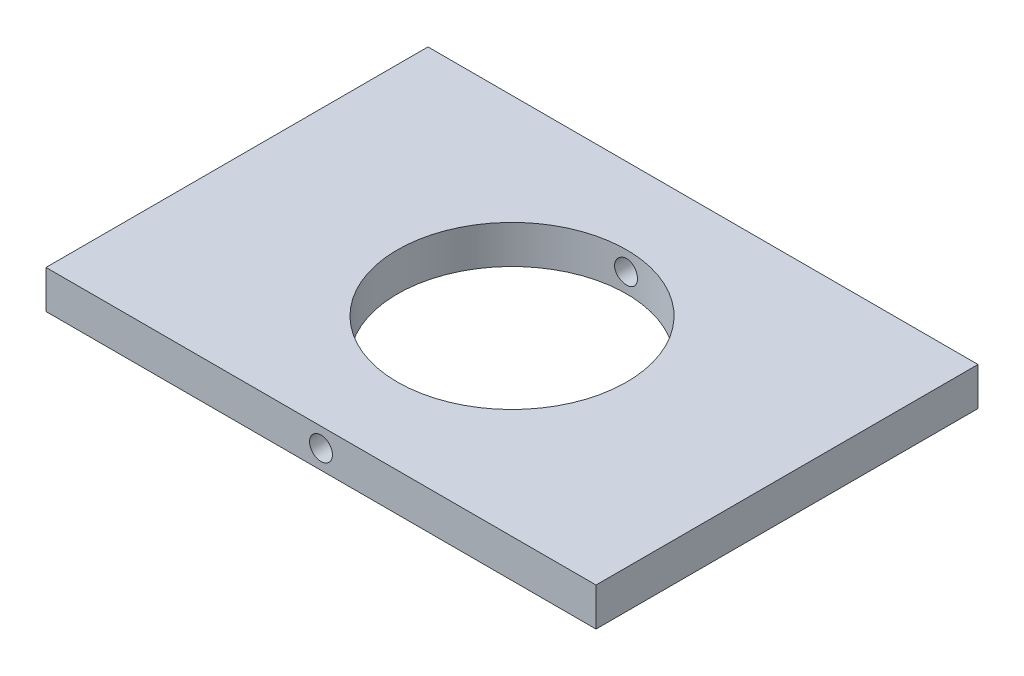
ISO-10303-21;
HEADER;
FILE_DESCRIPTION(('STEP AP214'),'2;1');
FILE_NAME('part.step','',(''),(''),'','','');
FILE_SCHEMA(('AUTOMOTIVE_DESIGN { 1 0 10303 214 1 1 1 1 }'));
ENDSEC;
DATA;
#1=APPLICATION_CONTEXT('core data for automotive mechanical design processes');
#2=APPLICATION_PROTOCOL_DEFINITION('international standard','automotive_design',2000,#1);
#3=PRODUCT_CONTEXT('',#1,'mechanical');
#4=PRODUCT('Part','Part','',(#3));
#5=PRODUCT_RELATED_PRODUCT_CATEGORY('part','',(#4));
#6=PRODUCT_DEFINITION_FORMATION('','',#4);
#7=PRODUCT_DEFINITION_CONTEXT('part definition',#1,'design');
#8=PRODUCT_DEFINITION('design','',#6,#7);
#9=PRODUCT_DEFINITION_SHAPE('','',#8);
#10=(LENGTH_UNIT() NAMED_UNIT(*) SI_UNIT(.MILLI.,.METRE.));
#11=(NAMED_UNIT(*) PLANE_ANGLE_UNIT() SI_UNIT($,.RADIAN.));
#12=(NAMED_UNIT(*) SI_UNIT($,.STERADIAN.) SOLID_ANGLE_UNIT());
#13=UNCERTAINTY_MEASURE_WITH_UNIT(LENGTH_MEASURE(1.E-05),#10,'distance_accuracy_value','');
#14=(GEOMETRIC_REPRESENTATION_CONTEXT(3) GLOBAL_UNCERTAINTY_ASSIGNED_CONTEXT((#13)) GLOBAL_UNIT_ASSIGNED_CONTEXT((#10,
#11,#12)) REPRESENTATION_CONTEXT('',''));
#15=CARTESIAN_POINT('',(0.,0.,0.));
#16=DIRECTION('',(0.,0.,1.));
#17=DIRECTION('',(1.,0.,0.));
#18=AXIS2_PLACEMENT_3D('',#15,#16,#17);
#19=CARTESIAN_POINT('',(-19.5,-45.,50.));
#20=DIRECTION('',(1.,0.,0.));
#21=DIRECTION('',(0.,0.,-1.));
#22=AXIS2_PLACEMENT_3D('',#19,#20,#21);
#23=PLANE('',#22);
#24=DIRECTION('',(0.,-1.,0.));
#25=VECTOR('',#24,1.);
#26=CARTESIAN_POINT('',(-19.5,-45.,0.));
#27=LINE('',#26,#25);
#28=CARTESIAN_POINT('',(-19.5,-45.,0.));
#29=VERTEX_POINT('',#28);
#30=CARTESIAN_POINT('',(-19.5,-50.,0.));
#31=VERTEX_POINT('',#30);
#32=EDGE_CURVE('E108',#29,#31,#27,.T.);
#33=ORIENTED_EDGE('',*,*,#32,.T.);
#34=DIRECTION('',(0.,0.,-1.));
#35=VECTOR('',#34,1.);
#36=CARTESIAN_POINT('',(-19.5,-50.,50.));
#37=LINE('',#36,#35);
#38=CARTESIAN_POINT('',(-19.5,-50.,50.));
#39=VERTEX_POINT('',#38);
#40=EDGE_CURVE('E11',#39,#31,#37,.T.);
#41=ORIENTED_EDGE('',*,*,#40,.F.);
#42=DIRECTION('',(0.,-1.,0.));
#43=VECTOR('',#42,1.);
#44=CARTESIAN_POINT('',(-19.5,-45.,50.));
#45=LINE('',#44,#43);
#46=CARTESIAN_POINT('',(-19.5,-45.,50.));
#47=VERTEX_POINT('',#46);
#48=EDGE_CURVE('E93',#47,#39,#45,.T.);
#49=ORIENTED_EDGE('',*,*,#48,.F.);
#50=DIRECTION('',(0.,0.,-1.));
#51=VECTOR('',#50,1.);
#52=CARTESIAN_POINT('',(-19.5,-45.,50.));
#53=LINE('',#52,#51);
#54=EDGE_CURVE('E60',#47,#29,#53,.T.);
#55=ORIENTED_EDGE('',*,*,#54,.T.);
#56=EDGE_LOOP('',(#33,#41,#49,#55));
#57=FACE_BOUND('',#56,.T.);
#58=ADVANCED_FACE('F37',(#57),#23,.F.);
#59=CARTESIAN_POINT('',(-19.5,-50.,50.));
#60=DIRECTION('',(0.,1.,0.));
#61=DIRECTION('',(0.,0.,1.));
#62=AXIS2_PLACEMENT_3D('',#59,#60,#61);
#63=PLANE('',#62);
#64=CARTESIAN_POINT('',(16.5,-50.,25.));
#65=DIRECTION('',(0.,1.,0.));
#66=DIRECTION('',(0.,0.,1.));
#67=AXIS2_PLACEMENT_3D('',#64,#65,#66);
#68=CIRCLE('',#67,15.);
#69=CARTESIAN_POINT('',(16.5,-50.,40.));
#70=VERTEX_POINT('',#69);
#71=EDGE_CURVE('E110',#70,#70,#68,.T.);
#72=ORIENTED_EDGE('',*,*,#71,.T.);
#73=EDGE_LOOP('',(#72));
#74=FACE_BOUND('',#73,.T.);
#75=DIRECTION('',(1.,0.,0.));
#76=VECTOR('',#75,1.);
#77=CARTESIAN_POINT('',(-19.5,-50.,0.));
#78=LINE('',#77,#76);
#79=CARTESIAN_POINT('',(52.5,-50.,0.));
#80=VERTEX_POINT('',#79);
#81=EDGE_CURVE('E98',#31,#80,#78,.T.);
#82=ORIENTED_EDGE('',*,*,#81,.T.);
#83=DIRECTION('',(0.,0.,-1.));
#84=VECTOR('',#83,1.);
#85=CARTESIAN_POINT('',(52.5,-50.,50.));
#86=LINE('',#85,#84);
#87=CARTESIAN_POINT('',(52.5,-50.,50.));
#88=VERTEX_POINT('',#87);
#89=EDGE_CURVE('E51',#88,#80,#86,.T.);
#90=ORIENTED_EDGE('',*,*,#89,.F.);
#91=DIRECTION('',(1.,0.,0.));
#92=VECTOR('',#91,1.);
#93=CARTESIAN_POINT('',(-19.5,-50.,50.));
#94=LINE('',#93,#92);
#95=EDGE_CURVE('E85',#39,#88,#94,.T.);
#96=ORIENTED_EDGE('',*,*,#95,.F.);
#97=ORIENTED_EDGE('',*,*,#40,.T.);
#98=EDGE_LOOP('',(#82,#90,#96,#97));
#99=FACE_BOUND('',#98,.T.);
#100=ADVANCED_FACE('F97',(#74,#99),#63,.F.);
#101=CARTESIAN_POINT('',(52.5,-45.,50.));
#102=DIRECTION('',(1.,0.,0.));
#103=DIRECTION('',(0.,0.,-1.));
#104=AXIS2_PLACEMENT_3D('',#101,#102,#103);
#105=PLANE('',#104);
#106=DIRECTION('',(0.,-1.,0.));
#107=VECTOR('',#106,1.);
#108=CARTESIAN_POINT('',(52.5,-45.,0.));
#109=LINE('',#108,#107);
#110=CARTESIAN_POINT('',(52.5,-45.,0.));
#111=VERTEX_POINT('',#110);
#112=EDGE_CURVE('E112',#111,#80,#109,.T.);
#113=ORIENTED_EDGE('',*,*,#112,.F.);
#114=DIRECTION('',(0.,0.,-1.));
#115=VECTOR('',#114,1.);
#116=CARTESIAN_POINT('',(52.5,-45.,50.));
#117=LINE('',#116,#115);
#118=CARTESIAN_POINT('',(52.5,-45.,50.));
#119=VERTEX_POINT('',#118);
#120=EDGE_CURVE('E74',#119,#111,#117,.T.);
#121=ORIENTED_EDGE('',*,*,#120,.F.);
#122=DIRECTION('',(0.,-1.,0.));
#123=VECTOR('',#122,1.);
#124=CARTESIAN_POINT('',(52.5,-45.,50.));
#125=LINE('',#124,#123);
#126=EDGE_CURVE('E92',#119,#88,#125,.T.);
#127=ORIENTED_EDGE('',*,*,#126,.T.);
#128=ORIENTED_EDGE('',*,*,#89,.T.);
#129=EDGE_LOOP('',(#113,#121,#127,#128));
#130=FACE_BOUND('',#129,.T.);
#131=ADVANCED_FACE('F102',(#130),#105,.T.);
#132=CARTESIAN_POINT('',(-19.5,-45.,50.));
#133=DIRECTION('',(0.,1.,0.));
#134=DIRECTION('',(0.,0.,1.));
#135=AXIS2_PLACEMENT_3D('',#132,#133,#134);
#136=PLANE('',#135);
#137=CARTESIAN_POINT('',(16.5,-45.,25.));
#138=DIRECTION('',(0.,1.,0.));
#139=DIRECTION('',(0.,0.,1.));
#140=AXIS2_PLACEMENT_3D('',#137,#138,#139);
#141=CIRCLE('',#140,15.);
#142=CARTESIAN_POINT('',(16.5,-45.,40.));
#143=VERTEX_POINT('',#142);
#144=EDGE_CURVE('E172',#143,#143,#141,.T.);
#145=ORIENTED_EDGE('',*,*,#144,.F.);
#146=EDGE_LOOP('',(#145));
#147=FACE_BOUND('',#146,.T.);
#148=DIRECTION('',(1.,0.,0.));
#149=VECTOR('',#148,1.);
#150=CARTESIAN_POINT('',(-19.5,-45.,0.));
#151=LINE('',#150,#149);
#152=EDGE_CURVE('E114',#29,#111,#151,.T.);
#153=ORIENTED_EDGE('',*,*,#152,.F.);
#154=ORIENTED_EDGE('',*,*,#54,.F.);
#155=DIRECTION('',(1.,0.,0.));
#156=VECTOR('',#155,1.);
#157=CARTESIAN_POINT('',(-19.5,-45.,50.));
#158=LINE('',#157,#156);
#159=EDGE_CURVE('E103',#47,#119,#158,.T.);
#160=ORIENTED_EDGE('',*,*,#159,.T.);
#161=ORIENTED_EDGE('',*,*,#120,.T.);
#162=EDGE_LOOP('',(#153,#154,#160,#161));
#163=FACE_BOUND('',#162,.T.);
#164=ADVANCED_FACE('F146',(#147,#163),#136,.T.);
#165=CARTESIAN_POINT('',(0.,0.,50.));
#166=DIRECTION('',(0.,0.,1.));
#167=DIRECTION('',(1.,0.,0.));
#168=AXIS2_PLACEMENT_3D('',#165,#166,#167);
#169=PLANE('',#168);
#170=CARTESIAN_POINT('',(16.5,-47.5,50.));
#171=DIRECTION('',(0.,0.,1.));
#172=DIRECTION('',(1.,0.,0.));
#173=AXIS2_PLACEMENT_3D('',#170,#171,#172);
#174=CIRCLE('',#173,1.5);
#175=CARTESIAN_POINT('',(18.,-47.5,50.));
#176=VERTEX_POINT('',#175);
#177=EDGE_CURVE('E166',#176,#176,#174,.T.);
#178=ORIENTED_EDGE('',*,*,#177,.F.);
#179=EDGE_LOOP('',(#178));
#180=FACE_BOUND('',#179,.T.);
#181=ORIENTED_EDGE('',*,*,#48,.T.);
#182=ORIENTED_EDGE('',*,*,#95,.T.);
#183=ORIENTED_EDGE('',*,*,#126,.F.);
#184=ORIENTED_EDGE('',*,*,#159,.F.);
#185=EDGE_LOOP('',(#181,#182,#183,#184));
#186=FACE_BOUND('',#185,.T.);
#187=ADVANCED_FACE('F89',(#180,#186),#169,.T.);
#188=CARTESIAN_POINT('',(0.,0.,0.));
#189=DIRECTION('',(0.,0.,1.));
#190=DIRECTION('',(1.,0.,0.));
#191=AXIS2_PLACEMENT_3D('',#188,#189,#190);
#192=PLANE('',#191);
#193=CARTESIAN_POINT('',(16.5,-47.5,0.));
#194=DIRECTION('',(0.,0.,1.));
#195=DIRECTION('',(1.,0.,0.));
#196=AXIS2_PLACEMENT_3D('',#193,#194,#195);
#197=CIRCLE('',#196,1.5);
#198=CARTESIAN_POINT('',(18.,-47.5,0.));
#199=VERTEX_POINT('',#198);
#200=EDGE_CURVE('E123',#199,#199,#197,.T.);
#201=ORIENTED_EDGE('',*,*,#200,.T.);
#202=EDGE_LOOP('',(#201));
#203=FACE_BOUND('',#202,.T.);
#204=ORIENTED_EDGE('',*,*,#32,.F.);
#205=ORIENTED_EDGE('',*,*,#152,.T.);
#206=ORIENTED_EDGE('',*,*,#112,.T.);
#207=ORIENTED_EDGE('',*,*,#81,.F.);
#208=EDGE_LOOP('',(#204,#205,#206,#207));
#209=FACE_BOUND('',#208,.T.);
#210=ADVANCED_FACE('F145',(#203,#209),#192,.F.);
#211=CARTESIAN_POINT('',(16.5,-50.,25.));
#212=DIRECTION('',(0.,1.,0.));
#213=DIRECTION('',(0.,0.,1.));
#214=AXIS2_PLACEMENT_3D('',#211,#212,#213);
#215=CYLINDRICAL_SURFACE('',#214,15.);
#216=CARTESIAN_POINT('',(16.5,-49.,40.));
#217=CARTESIAN_POINT('',(16.5840305306873,-48.9999963611494,39.9999990328115));
#218=CARTESIAN_POINT('',(16.6681166177517,-48.9929150966553,39.9992863839431));
#219=CARTESIAN_POINT('',(16.8339575977453,-48.9647734445644,39.9965120139211));
#220=CARTESIAN_POINT('',(16.9157098187532,-48.9436976559631,39.9944488065104));
#221=CARTESIAN_POINT('',(17.0744575131801,-48.8881866391033,39.9892062184461));
#222=CARTESIAN_POINT('',(17.1514558269224,-48.8537594792223,39.9860275120106));
#223=CARTESIAN_POINT('',(17.2985642414406,-48.7725386381025,39.9789093609146));
#224=CARTESIAN_POINT('',(17.3686757081686,-48.7257474159998,39.974970067572));
#225=CARTESIAN_POINT('',(17.5002893260111,-48.6209459535066,39.9667561651199));
#226=CARTESIAN_POINT('',(17.5617632172523,-48.5629003008969,39.962480523608));
#227=CARTESIAN_POINT('',(17.6741137821465,-48.4373131986055,39.9540843535939));
#228=CARTESIAN_POINT('',(17.724989965624,-48.3697713099364,39.9499638322737));
#229=CARTESIAN_POINT('',(17.8148009556654,-48.2269322024746,39.9423338732918));
#230=CARTESIAN_POINT('',(17.8537101981823,-48.1516188338577,39.9388257506636));
#231=CARTESIAN_POINT('',(17.9183195771141,-47.9954866211425,39.9328305631979));
#232=CARTESIAN_POINT('',(17.9440200398869,-47.9146679131241,39.9303434731333));
#233=CARTESIAN_POINT('',(17.9813985624028,-47.750107298701,39.9266812610947));
#234=CARTESIAN_POINT('',(17.9931234795057,-47.6663761347217,39.9255017559714));
#235=CARTESIAN_POINT('',(18.002362927703,-47.4981267049063,39.9245746459079));
#236=CARTESIAN_POINT('',(17.9998778323062,-47.4136084598169,39.9248270033312));
#237=CARTESIAN_POINT('',(17.980806420379,-47.24650703546,39.926731103484));
#238=CARTESIAN_POINT('',(17.9642712661868,-47.163917951007,39.9283777688598));
#239=CARTESIAN_POINT('',(17.9176487162259,-47.0026930551984,39.9328770143113));
#240=CARTESIAN_POINT('',(17.8875611373836,-46.9240572972625,39.9357296106774));
#241=CARTESIAN_POINT('',(17.8146313408223,-46.7728096190517,39.9423251417811));
#242=CARTESIAN_POINT('',(17.77176642408,-46.700208715766,39.9460696586224));
#243=CARTESIAN_POINT('',(17.6745150410298,-46.5632121776322,39.9540257759932));
#244=CARTESIAN_POINT('',(17.6201282375048,-46.4988167830274,39.9582373901918));
#245=CARTESIAN_POINT('',(17.5010911686181,-46.3797619090165,39.9666757796948));
#246=CARTESIAN_POINT('',(17.436396718277,-46.3251465971788,39.970902539995));
#247=CARTESIAN_POINT('',(17.2987342226057,-46.2275445506344,39.9788774361778));
#248=CARTESIAN_POINT('',(17.2257661679994,-46.1845578289653,39.9826255715238));
#249=CARTESIAN_POINT('',(17.0735971585385,-46.1114349695346,39.9892221350064));
#250=CARTESIAN_POINT('',(16.9943951195848,-46.0813010727729,39.9920704062215));
#251=CARTESIAN_POINT('',(16.8320208259949,-46.0347716249324,39.9965447116211));
#252=CARTESIAN_POINT('',(16.7488486901649,-46.0183756630141,39.998170782356));
#253=CARTESIAN_POINT('',(16.5812776486379,-45.9998435383979,40.0000127750247));
#254=CARTESIAN_POINT('',(16.4968855468418,-45.9976464276213,40.000234724016));
#255=CARTESIAN_POINT('',(16.3289343100264,-46.0074142945732,39.999259626352));
#256=CARTESIAN_POINT('',(16.2453751637693,-46.0193790809729,39.998062598867));
#257=CARTESIAN_POINT('',(16.081637689748,-46.0570805431324,39.9943879230879));
#258=CARTESIAN_POINT('',(16.001452726542,-46.082788681717,39.9919129287706));
#259=CARTESIAN_POINT('',(15.8465335179243,-46.1472177610559,39.9859599829091));
#260=CARTESIAN_POINT('',(15.7717993947643,-46.1859389935591,39.9824820088788));
#261=CARTESIAN_POINT('',(15.6296277297418,-46.2754462579959,39.9748971299563));
#262=CARTESIAN_POINT('',(15.5622155103766,-46.3262723333887,39.9707881540516));
#263=CARTESIAN_POINT('',(15.4368575650322,-46.4384891016114,39.9624089930428));
#264=CARTESIAN_POINT('',(15.3789120767262,-46.4998800596055,39.9581388038946));
#265=CARTESIAN_POINT('',(15.2739208351693,-46.6317498619885,39.9499003621113));
#266=CARTESIAN_POINT('',(15.2269150819807,-46.7022606348139,39.9459332520846));
#267=CARTESIAN_POINT('',(15.1454126118843,-46.85021104022,39.9387674869133));
#268=CARTESIAN_POINT('',(15.1109157239192,-46.9276505780326,39.9355688212606));
#269=CARTESIAN_POINT('',(15.0554771869733,-47.0871231091987,39.9303092145107));
#270=CARTESIAN_POINT('',(15.0345117377822,-47.1691477601367,39.9282462767468));
#271=CARTESIAN_POINT('',(15.0066539893058,-47.3355747969412,39.9254854792432));
#272=CARTESIAN_POINT('',(14.9997612864007,-47.4199771145435,39.9247875803528));
#273=CARTESIAN_POINT('',(15.0002502922931,-47.5883660325351,39.9248366966134));
#274=CARTESIAN_POINT('',(15.0075691656103,-47.6723528243242,39.9255773513051));
#275=CARTESIAN_POINT('',(15.0361418205545,-47.8378973757524,39.9284065583432));
#276=CARTESIAN_POINT('',(15.0573956178568,-47.919455132659,39.9304951122058));
#277=CARTESIAN_POINT('',(15.1132174705537,-48.0778260235718,39.9357830239478));
#278=CARTESIAN_POINT('',(15.1477836834886,-48.1546398124446,39.9389822281054));
#279=CARTESIAN_POINT('',(15.2292426676334,-48.3013853375066,39.9461312775904));
#280=CARTESIAN_POINT('',(15.2761353698169,-48.371317112231,39.9500811187143));
#281=CARTESIAN_POINT('',(15.381152165572,-48.5026355117079,39.9583073081455));
#282=CARTESIAN_POINT('',(15.4393230766646,-48.5639846145506,39.9625849709013));
#283=CARTESIAN_POINT('',(15.5651524511623,-48.6760783490495,39.9709728209318));
#284=CARTESIAN_POINT('',(15.6328131838376,-48.7268204370358,39.9750829678446));
#285=CARTESIAN_POINT('',(15.7758878487581,-48.8163601807819,39.9826834310374));
#286=CARTESIAN_POINT('',(15.8513208759799,-48.8551274364178,39.9861721604022));
#287=CARTESIAN_POINT('',(16.0076125813492,-48.9193936342358,39.9921194387484));
#288=CARTESIAN_POINT('',(16.0884650252616,-48.9449075364303,39.9945791486448));
#289=CARTESIAN_POINT('',(16.2248126078915,-48.9755809256272,39.997573206606));
#290=CARTESIAN_POINT('',(16.2794361707332,-48.9847255664491,39.9984790103775));
#291=CARTESIAN_POINT('',(16.389365128774,-48.9969362890927,39.9996927242618));
#292=CARTESIAN_POINT('',(16.4446705211602,-49.0000023959828,40.0000006368404));
#293=CARTESIAN_POINT('',(16.5,-49.,40.));
#294=B_SPLINE_CURVE_WITH_KNOTS('',3,(#216,#217,#218,#219,#220,#221,#222,#223,#224,#225,#226,
#227,#228,#229,#230,#231,#232,#233,#234,#235,#236,#237,#238,#239,#240,#241,#242,#243,#244,#245,
#246,#247,#248,#249,#250,#251,#252,#253,#254,#255,#256,#257,#258,#259,#260,#261,#262,#263,#264,
#265,#266,#267,#268,#269,#270,#271,#272,#273,#274,#275,#276,#277,#278,#279,#280,#281,#282,#283,
#284,#285,#286,#287,#288,#289,#290,#291,#292,#293),.UNSPECIFIED.,.T.,.F.,(4,2,2,2,2,2,2,2,2,2,2,
2,2,2,2,2,2,2,2,2,2,2,2,2,2,2,2,2,2,2,2,2,2,2,2,2,2,2,4),(0.,0.25188954940271,0.50405676425323,
0.756071828598303,1.00803680637417,1.26080785293442,1.51359058831059,1.76690963208333,
2.02022241663756,2.27268348067795,2.52513790883665,2.77667696161666,3.02821941242451,
3.28021142059343,3.53221080496689,3.78532101294311,4.03843150469658,4.29158611040373,
4.5447331451316,4.79679282911637,5.04884910778716,5.30038402941457,5.55192459074201,
5.80430911123049,6.05669996715346,6.30999965412898,6.56329587713062,6.81614535889506,
7.06898758859379,7.32071443940935,7.57244157339059,7.82413388044201,8.07582477808441,
8.3285837614148,8.58140328955438,8.83485946539364,9.08802892192943,9.25388500848524,
9.41974041103542),.UNSPECIFIED.);
#295=CARTESIAN_POINT('',(16.5,-49.,40.));
#296=VERTEX_POINT('',#295);
#297=EDGE_CURVE('E40',#296,#296,#294,.T.);
#298=ORIENTED_EDGE('',*,*,#297,.T.);
#299=EDGE_LOOP('',(#298));
#300=FACE_BOUND('',#299,.T.);
#301=CARTESIAN_POINT('',(18.,-47.5,10.0751884434007));
#302=CARTESIAN_POINT('',(17.9999963600903,-47.5840293462604,10.0751874580465));
#303=CARTESIAN_POINT('',(17.9929152884737,-47.6681142526178,10.0744711450867));
#304=CARTESIAN_POINT('',(17.9647744721453,-47.8339527794403,10.0716836866282));
#305=CARTESIAN_POINT('',(17.9436993223297,-47.9157037270562,10.0696110480817));
#306=CARTESIAN_POINT('',(17.8881901741034,-48.0744487288269,10.0643480042892));
#307=CARTESIAN_POINT('',(17.8537642744408,-48.1514456340872,10.0611582767982));
#308=CARTESIAN_POINT('',(17.7725464010867,-48.2985516884376,10.0540212914227));
#309=CARTESIAN_POINT('',(17.7257568834389,-48.3686622017256,10.0500741840351));
#310=CARTESIAN_POINT('',(17.6209571429981,-48.5002768954863,10.0418510993515));
#311=CARTESIAN_POINT('',(17.5629111271624,-48.5617525142557,10.037574099921));
#312=CARTESIAN_POINT('',(17.4373225729793,-48.6741064135054,10.0291824214642));
#313=CARTESIAN_POINT('',(17.3697796003599,-48.7249842091095,10.0250677498718));
#314=CARTESIAN_POINT('',(17.2269395424765,-48.8147968855107,10.0174542526659));
#315=CARTESIAN_POINT('',(17.1516264937944,-48.8537064981905,10.0139567365803));
#316=CARTESIAN_POINT('',(16.9954949764313,-48.918316649723,10.0079827468634));
#317=CARTESIAN_POINT('',(16.9146766420023,-48.9440175105542,10.005506248344));
#318=CARTESIAN_POINT('',(16.7501171741144,-48.9813968640299,10.0018605014346));
#319=CARTESIAN_POINT('',(16.6663867905474,-48.9931222491249,10.0006868823578));
#320=CARTESIAN_POINT('',(16.4981388889666,-49.0023629037006,9.99976426601962));
#321=CARTESIAN_POINT('',(16.4136213914183,-48.9998785416194,10.0000152318209));
#322=CARTESIAN_POINT('',(16.2465167339032,-48.9808082910248,10.0019099303322));
#323=CARTESIAN_POINT('',(16.1639237550975,-48.9642728266542,10.0035486827243));
#324=CARTESIAN_POINT('',(16.0026912307432,-48.9176483065801,10.008029061026));
#325=CARTESIAN_POINT('',(15.9240517365634,-48.8875590748186,10.0108707025607));
#326=CARTESIAN_POINT('',(15.7727995279806,-48.8146258551183,10.0174459377413));
#327=CARTESIAN_POINT('',(15.7001976435275,-48.7717595537048,10.0211810895136));
#328=CARTESIAN_POINT('',(15.5631997302387,-48.6745052149954,10.0291242322089));
#329=CARTESIAN_POINT('',(15.4988039421588,-48.6201168397822,10.0333322369978));
#330=CARTESIAN_POINT('',(15.379750842266,-48.5010786557295,10.0417705979822));
#331=CARTESIAN_POINT('',(15.3251373807145,-48.4363849828876,10.0460009714046));
#332=CARTESIAN_POINT('',(15.2275386969631,-48.2987247021838,10.0539889010767));
#333=CARTESIAN_POINT('',(15.1845534916307,-48.2257580823218,10.0577464566405));
#334=CARTESIAN_POINT('',(15.1114317231402,-48.0735894622003,10.0643636572878));
#335=CARTESIAN_POINT('',(15.0812978691406,-47.9943861513657,10.0672231130117));
#336=CARTESIAN_POINT('',(15.0347688965436,-47.832009093078,10.0717164719359));
#337=CARTESIAN_POINT('',(15.0183733593854,-47.7488354666688,10.0733504124735));
#338=CARTESIAN_POINT('',(14.9998428369121,-47.5812637307057,10.0752012920888));
#339=CARTESIAN_POINT('',(14.9976465050292,-47.4968724696027,10.075424326786));
#340=CARTESIAN_POINT('',(15.007415629693,-47.3289231012657,10.0744442296784));
#341=CARTESIAN_POINT('',(15.0193808948854,-47.2453649827894,10.0732411171441));
#342=CARTESIAN_POINT('',(15.0570822382387,-47.0816326265825,10.069549833664));
#343=CARTESIAN_POINT('',(15.0827893092166,-47.001451643358,10.0670643699798));
#344=CARTESIAN_POINT('',(15.1472149204861,-46.8465399224045,10.0610906344181));
#345=CARTESIAN_POINT('',(15.1859337588246,-46.7718093095692,10.05760233957));
#346=CARTESIAN_POINT('',(15.2754374978652,-46.6296400389568,10.0500012346643));
#347=CARTESIAN_POINT('',(15.326263050239,-46.5622270870506,10.0458863377799));
#348=CARTESIAN_POINT('',(15.4384791998232,-46.4368674200889,10.0375025106222));
#349=CARTESIAN_POINT('',(15.4998700586278,-46.3789209394899,10.033233576537));
#350=CARTESIAN_POINT('',(15.6317402936603,-46.2739275499029,10.0250042822605));
#351=CARTESIAN_POINT('',(15.7022516160458,-46.2269206606207,10.0210450891679));
#352=CARTESIAN_POINT('',(15.8502034238743,-46.1454161972404,10.0138983684005));
#353=CARTESIAN_POINT('',(15.9276438143556,-46.1109184517394,10.0107108301526));
#354=CARTESIAN_POINT('',(16.0871158103508,-46.055479348517,10.0054718437899));
#355=CARTESIAN_POINT('',(16.1691389435251,-46.0345138190122,10.0034183709153));
#356=CARTESIAN_POINT('',(16.3355627790245,-46.0066553956302,10.0006705807953));
#357=CARTESIAN_POINT('',(16.4199634144617,-45.9997621062489,9.99997622535156));
#358=CARTESIAN_POINT('',(16.5883533361136,-46.0002493996599,10.000024925301));
#359=CARTESIAN_POINT('',(16.6723428108368,-46.007567855255,10.00076172435));
#360=CARTESIAN_POINT('',(16.8378928325345,-46.0361406184855,10.0035775963361));
#361=CARTESIAN_POINT('',(16.9194533776025,-46.0573949370595,10.0056566703269));
#362=CARTESIAN_POINT('',(17.0778298631516,-46.1132188860894,10.0109241427906));
#363=CARTESIAN_POINT('',(17.1546464491163,-46.1477867004012,10.0141123899513));
#364=CARTESIAN_POINT('',(17.3013969002322,-46.2292497533755,10.0212428137556));
#365=CARTESIAN_POINT('',(17.3713308056528,-46.2761449199067,10.0251849859877));
#366=CARTESIAN_POINT('',(17.5026490866404,-46.3811644285356,10.0334022299642));
#367=CARTESIAN_POINT('',(17.563996389329,-46.4393350243672,10.0376786280895));
#368=CARTESIAN_POINT('',(17.6760866390897,-46.5651630273182,10.0460711384551));
#369=CARTESIAN_POINT('',(17.7268270377718,-46.6328227077536,10.0501872119833));
#370=CARTESIAN_POINT('',(17.8163649606361,-46.7758965128799,10.057804248841));
#371=CARTESIAN_POINT('',(17.8551317819923,-46.8513299219861,10.0613036211204));
#372=CARTESIAN_POINT('',(17.9193970621482,-47.0076224368694,10.0672720785631));
#373=CARTESIAN_POINT('',(17.9449104868348,-47.0884753058886,10.0697423251996));
#374=CARTESIAN_POINT('',(17.9755825325003,-47.2248216113487,10.0727498869278));
#375=CARTESIAN_POINT('',(17.9847265685973,-47.2794433769596,10.0736600209646));
#376=CARTESIAN_POINT('',(17.9969364879077,-47.3893687345638,10.0748796223351));
#377=CARTESIAN_POINT('',(18.0000023966359,-47.4446723236939,10.0751890921902));
#378=CARTESIAN_POINT('',(18.,-47.5,10.0751884434007));
#379=B_SPLINE_CURVE_WITH_KNOTS('',3,(#301,#302,#303,#304,#305,#306,#307,#308,#309,#310,#311,
#312,#313,#314,#315,#316,#317,#318,#319,#320,#321,#322,#323,#324,#325,#326,#327,#328,#329,#330,
#331,#332,#333,#334,#335,#336,#337,#338,#339,#340,#341,#342,#343,#344,#345,#346,#347,#348,#349,
#350,#351,#352,#353,#354,#355,#356,#357,#358,#359,#360,#361,#362,#363,#364,#365,#366,#367,#368,
#369,#370,#371,#372,#373,#374,#375,#376,#377,#378),.UNSPECIFIED.,.T.,.F.,(4,2,2,2,2,2,2,2,2,2,2,
2,2,2,2,2,2,2,2,2,2,2,2,2,2,2,2,2,2,2,2,2,2,2,2,2,2,2,4),(0.,0.251885991654698,
0.504049727732654,0.756060736496216,1.00802172063198,1.26079742294888,1.51358468782879,
1.76690204956938,2.02021323611692,2.27267206347675,2.52512434497349,2.77667447727993,
3.02822787721462,3.28022318199621,3.53222587827793,3.78533137627502,4.03843724141344,
4.29159643676901,4.5447479189255,4.79680494461649,5.04885856450306,5.30038222056791,
5.55191163841571,5.80429784717577,6.05669030584804,6.30999205227178,6.56329032777008,
6.81613489041542,7.06897234669724,7.32070700202725,7.57244185494987,7.82414237992869,
8.07584143216198,8.32859572556983,8.58141067551788,8.83486861605715,9.08803972341001,
9.25389041409069,9.41974040855723),.UNSPECIFIED.);
#380=CARTESIAN_POINT('',(18.,-47.5,10.0751884434007));
#381=VERTEX_POINT('',#380);
#382=EDGE_CURVE('E118',#381,#381,#379,.T.);
#383=ORIENTED_EDGE('',*,*,#382,.T.);
#384=EDGE_LOOP('',(#383));
#385=FACE_BOUND('',#384,.T.);
#386=ORIENTED_EDGE('',*,*,#71,.F.);
#387=EDGE_LOOP('',(#386));
#388=FACE_BOUND('',#387,.T.);
#389=ORIENTED_EDGE('',*,*,#144,.T.);
#390=EDGE_LOOP('',(#389));
#391=FACE_BOUND('',#390,.T.);
#392=ADVANCED_FACE('F124',(#300,#385,#388,#391),#215,.F.);
#393=CARTESIAN_POINT('',(16.5,-47.5,0.));
#394=DIRECTION('',(0.,0.,1.));
#395=DIRECTION('',(1.,0.,0.));
#396=AXIS2_PLACEMENT_3D('',#393,#394,#395);
#397=CYLINDRICAL_SURFACE('',#396,1.5);
#398=ORIENTED_EDGE('',*,*,#200,.F.);
#399=EDGE_LOOP('',(#398));
#400=FACE_BOUND('',#399,.T.);
#401=ORIENTED_EDGE('',*,*,#382,.F.);
#402=EDGE_LOOP('',(#401));
#403=FACE_BOUND('',#402,.T.);
#404=ADVANCED_FACE('F130',(#400,#403),#397,.F.);
#405=ORIENTED_EDGE('',*,*,#177,.T.);
#406=EDGE_LOOP('',(#405));
#407=FACE_BOUND('',#406,.T.);
#408=ORIENTED_EDGE('',*,*,#297,.F.);
#409=EDGE_LOOP('',(#408));
#410=FACE_BOUND('',#409,.T.);
#411=ADVANCED_FACE('F127',(#407,#410),#397,.F.);
#412=CLOSED_SHELL('',(#58,#100,#131,#164,#187,#210,#392,#404,#411));
#413=MANIFOLD_SOLID_BREP('B2',#412);
#414=ADVANCED_BREP_SHAPE_REPRESENTATION('',(#18,#413),#14);
#415=SHAPE_DEFINITION_REPRESENTATION(#9,#414);
ENDSEC;
END-ISO-10303-21;
